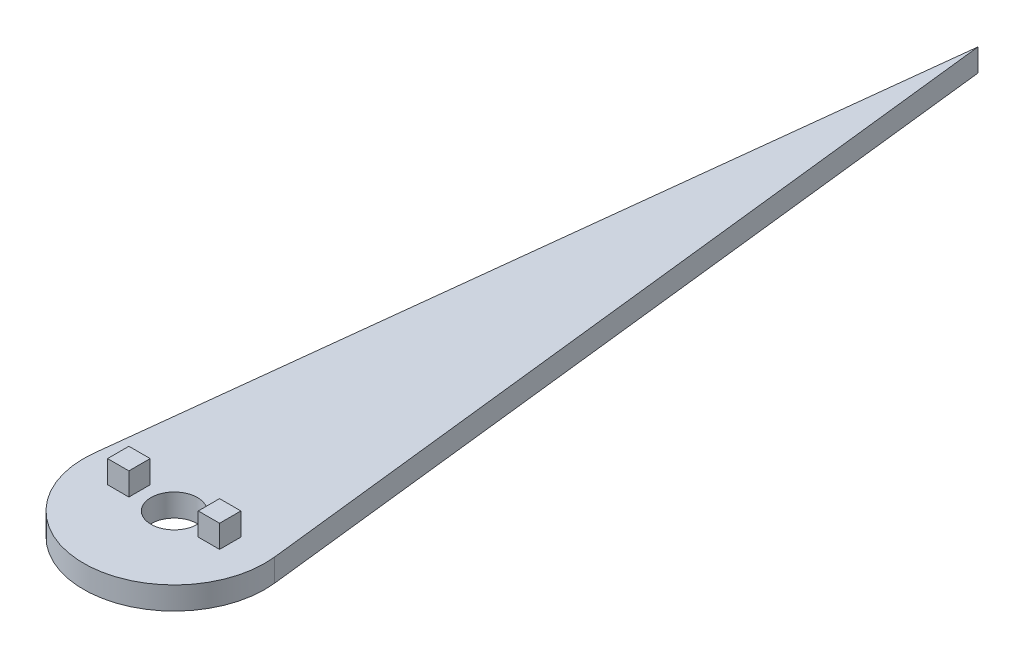
ISO-10303-21;
HEADER;
FILE_DESCRIPTION(('STEP AP214'),'2;1');
FILE_NAME('part.step','',(''),(''),'','','');
FILE_SCHEMA(('AUTOMOTIVE_DESIGN { 1 0 10303 214 1 1 1 1 }'));
ENDSEC;
DATA;
#1=APPLICATION_CONTEXT('core data for automotive mechanical design processes');
#2=APPLICATION_PROTOCOL_DEFINITION('international standard','automotive_design',2000,#1);
#3=PRODUCT_CONTEXT('',#1,'mechanical');
#4=PRODUCT('Part','Part','',(#3));
#5=PRODUCT_RELATED_PRODUCT_CATEGORY('part','',(#4));
#6=PRODUCT_DEFINITION_FORMATION('','',#4);
#7=PRODUCT_DEFINITION_CONTEXT('part definition',#1,'design');
#8=PRODUCT_DEFINITION('design','',#6,#7);
#9=PRODUCT_DEFINITION_SHAPE('','',#8);
#10=(LENGTH_UNIT() NAMED_UNIT(*) SI_UNIT(.MILLI.,.METRE.));
#11=(NAMED_UNIT(*) PLANE_ANGLE_UNIT() SI_UNIT($,.RADIAN.));
#12=(NAMED_UNIT(*) SI_UNIT($,.STERADIAN.) SOLID_ANGLE_UNIT());
#13=UNCERTAINTY_MEASURE_WITH_UNIT(LENGTH_MEASURE(1.E-05),#10,'distance_accuracy_value','');
#14=(GEOMETRIC_REPRESENTATION_CONTEXT(3) GLOBAL_UNCERTAINTY_ASSIGNED_CONTEXT((#13)) GLOBAL_UNIT_ASSIGNED_CONTEXT((#10,
#11,#12)) REPRESENTATION_CONTEXT('',''));
#15=CARTESIAN_POINT('',(0.,0.,0.));
#16=DIRECTION('',(0.,0.,1.));
#17=DIRECTION('',(1.,0.,0.));
#18=AXIS2_PLACEMENT_3D('',#15,#16,#17);
#19=CARTESIAN_POINT('',(0.,5.,0.));
#20=DIRECTION('',(0.,1.,0.));
#21=DIRECTION('',(0.,0.,1.));
#22=AXIS2_PLACEMENT_3D('',#19,#20,#21);
#23=PLANE('',#22);
#24=CARTESIAN_POINT('',(0.,5.,0.));
#25=DIRECTION('',(0.,1.,0.));
#26=DIRECTION('',(0.,0.,1.));
#27=AXIS2_PLACEMENT_3D('',#24,#25,#26);
#28=CIRCLE('',#27,20.);
#29=CARTESIAN_POINT('',(-19.8722843965965,5.,-2.2566153550812));
#30=VERTEX_POINT('',#29);
#31=CARTESIAN_POINT('',(19.8722843965965,5.,-2.25661535508119));
#32=VERTEX_POINT('',#31);
#33=EDGE_CURVE('E217',#30,#32,#28,.T.);
#34=ORIENTED_EDGE('',*,*,#33,.T.);
#35=DIRECTION('',(-0.11283076775406,0.,-0.993614219829824));
#36=VECTOR('',#35,1.);
#37=CARTESIAN_POINT('',(0.,5.,-177.256615355081));
#38=LINE('',#37,#36);
#39=CARTESIAN_POINT('',(0.,5.,-177.256615355081));
#40=VERTEX_POINT('',#39);
#41=EDGE_CURVE('E221',#32,#40,#38,.T.);
#42=ORIENTED_EDGE('',*,*,#41,.T.);
#43=DIRECTION('',(-0.112830767754061,0.,0.993614219829824));
#44=VECTOR('',#43,1.);
#45=CARTESIAN_POINT('',(-19.8722843965965,5.,-2.2566153550812));
#46=LINE('',#45,#44);
#47=EDGE_CURVE('E225',#40,#30,#46,.T.);
#48=ORIENTED_EDGE('',*,*,#47,.T.);
#49=EDGE_LOOP('',(#34,#42,#48));
#50=FACE_BOUND('',#49,.T.);
#51=CARTESIAN_POINT('',(0.,5.,0.));
#52=DIRECTION('',(0.,1.,0.));
#53=DIRECTION('',(0.,0.,1.));
#54=AXIS2_PLACEMENT_3D('',#51,#52,#53);
#55=CIRCLE('',#54,5.125);
#56=CARTESIAN_POINT('',(0.,5.,5.12500000000001));
#57=VERTEX_POINT('',#56);
#58=EDGE_CURVE('E209',#57,#57,#55,.T.);
#59=ORIENTED_EDGE('',*,*,#58,.F.);
#60=EDGE_LOOP('',(#59));
#61=FACE_BOUND('',#60,.T.);
#62=DIRECTION('',(-1.,0.,0.));
#63=VECTOR('',#62,1.);
#64=CARTESIAN_POINT('',(7.65,5.,-2.35));
#65=LINE('',#64,#63);
#66=CARTESIAN_POINT('',(12.35,5.,-2.35));
#67=VERTEX_POINT('',#66);
#68=CARTESIAN_POINT('',(7.65,5.,-2.35));
#69=VERTEX_POINT('',#68);
#70=EDGE_CURVE('E159',#67,#69,#65,.T.);
#71=ORIENTED_EDGE('',*,*,#70,.F.);
#72=DIRECTION('',(0.,0.,-1.));
#73=VECTOR('',#72,1.);
#74=CARTESIAN_POINT('',(12.35,5.,2.35));
#75=LINE('',#74,#73);
#76=CARTESIAN_POINT('',(12.35,5.,2.35));
#77=VERTEX_POINT('',#76);
#78=EDGE_CURVE('E154',#77,#67,#75,.T.);
#79=ORIENTED_EDGE('',*,*,#78,.F.);
#80=DIRECTION('',(1.,0.,0.));
#81=VECTOR('',#80,1.);
#82=CARTESIAN_POINT('',(7.65,5.,2.35));
#83=LINE('',#82,#81);
#84=CARTESIAN_POINT('',(7.65,5.,2.35));
#85=VERTEX_POINT('',#84);
#86=EDGE_CURVE('E179',#85,#77,#83,.T.);
#87=ORIENTED_EDGE('',*,*,#86,.F.);
#88=DIRECTION('',(0.,0.,1.));
#89=VECTOR('',#88,1.);
#90=CARTESIAN_POINT('',(7.65,5.,2.35));
#91=LINE('',#90,#89);
#92=EDGE_CURVE('E191',#69,#85,#91,.T.);
#93=ORIENTED_EDGE('',*,*,#92,.F.);
#94=EDGE_LOOP('',(#71,#79,#87,#93));
#95=FACE_BOUND('',#94,.T.);
#96=DIRECTION('',(-1.,0.,0.));
#97=VECTOR('',#96,1.);
#98=CARTESIAN_POINT('',(-12.35,5.,-2.35));
#99=LINE('',#98,#97);
#100=CARTESIAN_POINT('',(-7.65,5.,-2.35));
#101=VERTEX_POINT('',#100);
#102=CARTESIAN_POINT('',(-12.35,5.,-2.35));
#103=VERTEX_POINT('',#102);
#104=EDGE_CURVE('E152',#101,#103,#99,.T.);
#105=ORIENTED_EDGE('',*,*,#104,.F.);
#106=DIRECTION('',(0.,0.,-1.));
#107=VECTOR('',#106,1.);
#108=CARTESIAN_POINT('',(-7.65,5.,2.35));
#109=LINE('',#108,#107);
#110=CARTESIAN_POINT('',(-7.65,5.,2.35));
#111=VERTEX_POINT('',#110);
#112=EDGE_CURVE('E146',#111,#101,#109,.T.);
#113=ORIENTED_EDGE('',*,*,#112,.F.);
#114=DIRECTION('',(1.,0.,0.));
#115=VECTOR('',#114,1.);
#116=CARTESIAN_POINT('',(-12.35,5.,2.35));
#117=LINE('',#116,#115);
#118=CARTESIAN_POINT('',(-12.35,5.,2.35));
#119=VERTEX_POINT('',#118);
#120=EDGE_CURVE('E130',#119,#111,#117,.T.);
#121=ORIENTED_EDGE('',*,*,#120,.F.);
#122=DIRECTION('',(0.,0.,1.));
#123=VECTOR('',#122,1.);
#124=CARTESIAN_POINT('',(-12.35,5.,2.35));
#125=LINE('',#124,#123);
#126=EDGE_CURVE('E139',#103,#119,#125,.T.);
#127=ORIENTED_EDGE('',*,*,#126,.F.);
#128=EDGE_LOOP('',(#105,#113,#121,#127));
#129=FACE_BOUND('',#128,.T.);
#130=ADVANCED_FACE('F45',(#50,#61,#95,#129),#23,.T.);
#131=CARTESIAN_POINT('',(0.,0.,0.));
#132=DIRECTION('',(0.,1.,0.));
#133=DIRECTION('',(0.,0.,1.));
#134=AXIS2_PLACEMENT_3D('',#131,#132,#133);
#135=PLANE('',#134);
#136=CARTESIAN_POINT('',(0.,0.,0.));
#137=DIRECTION('',(0.,1.,0.));
#138=DIRECTION('',(0.,0.,1.));
#139=AXIS2_PLACEMENT_3D('',#136,#137,#138);
#140=CIRCLE('',#139,20.);
#141=CARTESIAN_POINT('',(-19.8722843965965,0.,-2.2566153550812));
#142=VERTEX_POINT('',#141);
#143=CARTESIAN_POINT('',(19.8722843965965,0.,-2.25661535508119));
#144=VERTEX_POINT('',#143);
#145=EDGE_CURVE('E213',#142,#144,#140,.T.);
#146=ORIENTED_EDGE('',*,*,#145,.F.);
#147=DIRECTION('',(-0.112830767754061,0.,0.993614219829824));
#148=VECTOR('',#147,1.);
#149=CARTESIAN_POINT('',(-19.8722843965965,0.,-2.2566153550812));
#150=LINE('',#149,#148);
#151=CARTESIAN_POINT('',(0.,0.,-177.256615355081));
#152=VERTEX_POINT('',#151);
#153=EDGE_CURVE('E222',#152,#142,#150,.T.);
#154=ORIENTED_EDGE('',*,*,#153,.F.);
#155=DIRECTION('',(-0.11283076775406,0.,-0.993614219829824));
#156=VECTOR('',#155,1.);
#157=CARTESIAN_POINT('',(0.,0.,-177.256615355081));
#158=LINE('',#157,#156);
#159=EDGE_CURVE('E232',#144,#152,#158,.T.);
#160=ORIENTED_EDGE('',*,*,#159,.F.);
#161=EDGE_LOOP('',(#146,#154,#160));
#162=FACE_BOUND('',#161,.T.);
#163=CARTESIAN_POINT('',(0.,0.,0.));
#164=DIRECTION('',(0.,1.,0.));
#165=DIRECTION('',(0.,0.,1.));
#166=AXIS2_PLACEMENT_3D('',#163,#164,#165);
#167=CIRCLE('',#166,5.125);
#168=CARTESIAN_POINT('',(0.,0.,5.12500000000001));
#169=VERTEX_POINT('',#168);
#170=EDGE_CURVE('E208',#169,#169,#167,.T.);
#171=ORIENTED_EDGE('',*,*,#170,.T.);
#172=EDGE_LOOP('',(#171));
#173=FACE_BOUND('',#172,.T.);
#174=ADVANCED_FACE('F250',(#162,#173),#135,.F.);
#175=CARTESIAN_POINT('',(0.,5.,0.));
#176=DIRECTION('',(0.,-1.,0.));
#177=DIRECTION('',(0.,0.,-1.));
#178=AXIS2_PLACEMENT_3D('',#175,#176,#177);
#179=CYLINDRICAL_SURFACE('',#178,20.);
#180=ORIENTED_EDGE('',*,*,#145,.T.);
#181=DIRECTION('',(0.,-1.,0.));
#182=VECTOR('',#181,1.);
#183=CARTESIAN_POINT('',(19.8722843965965,5.,-2.25661535508119));
#184=LINE('',#183,#182);
#185=EDGE_CURVE('E11',#32,#144,#184,.T.);
#186=ORIENTED_EDGE('',*,*,#185,.F.);
#187=ORIENTED_EDGE('',*,*,#33,.F.);
#188=DIRECTION('',(0.,-1.,0.));
#189=VECTOR('',#188,1.);
#190=CARTESIAN_POINT('',(-19.8722843965965,5.,-2.2566153550812));
#191=LINE('',#190,#189);
#192=EDGE_CURVE('E228',#30,#142,#191,.T.);
#193=ORIENTED_EDGE('',*,*,#192,.T.);
#194=EDGE_LOOP('',(#180,#186,#187,#193));
#195=FACE_BOUND('',#194,.T.);
#196=ADVANCED_FACE('F47',(#195),#179,.T.);
#197=CARTESIAN_POINT('',(0.,5.,-177.256615355081));
#198=DIRECTION('',(-0.993614219829824,0.,0.112830767754061));
#199=DIRECTION('',(0.112830767754061,0.,0.993614219829824));
#200=AXIS2_PLACEMENT_3D('',#197,#198,#199);
#201=PLANE('',#200);
#202=ORIENTED_EDGE('',*,*,#159,.T.);
#203=DIRECTION('',(0.,-1.,0.));
#204=VECTOR('',#203,1.);
#205=CARTESIAN_POINT('',(0.,5.,-177.256615355081));
#206=LINE('',#205,#204);
#207=EDGE_CURVE('E54',#40,#152,#206,.T.);
#208=ORIENTED_EDGE('',*,*,#207,.F.);
#209=ORIENTED_EDGE('',*,*,#41,.F.);
#210=ORIENTED_EDGE('',*,*,#185,.T.);
#211=EDGE_LOOP('',(#202,#208,#209,#210));
#212=FACE_BOUND('',#211,.T.);
#213=ADVANCED_FACE('F257',(#212),#201,.F.);
#214=CARTESIAN_POINT('',(-19.8722843965965,5.,-2.2566153550812));
#215=DIRECTION('',(0.993614219829824,0.,0.112830767754061));
#216=DIRECTION('',(0.112830767754061,0.,-0.993614219829824));
#217=AXIS2_PLACEMENT_3D('',#214,#215,#216);
#218=PLANE('',#217);
#219=ORIENTED_EDGE('',*,*,#153,.T.);
#220=ORIENTED_EDGE('',*,*,#192,.F.);
#221=ORIENTED_EDGE('',*,*,#47,.F.);
#222=ORIENTED_EDGE('',*,*,#207,.T.);
#223=EDGE_LOOP('',(#219,#220,#221,#222));
#224=FACE_BOUND('',#223,.T.);
#225=ADVANCED_FACE('F245',(#224),#218,.F.);
#226=CARTESIAN_POINT('',(0.,5.,0.));
#227=DIRECTION('',(0.,-1.,0.));
#228=DIRECTION('',(0.,0.,-1.));
#229=AXIS2_PLACEMENT_3D('',#226,#227,#228);
#230=CYLINDRICAL_SURFACE('',#229,5.125);
#231=ORIENTED_EDGE('',*,*,#58,.T.);
#232=EDGE_LOOP('',(#231));
#233=FACE_BOUND('',#232,.T.);
#234=ORIENTED_EDGE('',*,*,#170,.F.);
#235=EDGE_LOOP('',(#234));
#236=FACE_BOUND('',#235,.T.);
#237=ADVANCED_FACE('F263',(#233,#236),#230,.F.);
#238=CARTESIAN_POINT('',(12.35,10.,2.35));
#239=DIRECTION('',(-1.,0.,0.));
#240=DIRECTION('',(0.,0.,1.));
#241=AXIS2_PLACEMENT_3D('',#238,#239,#240);
#242=PLANE('',#241);
#243=ORIENTED_EDGE('',*,*,#78,.T.);
#244=DIRECTION('',(0.,-1.,0.));
#245=VECTOR('',#244,1.);
#246=CARTESIAN_POINT('',(12.35,10.,-2.35));
#247=LINE('',#246,#245);
#248=CARTESIAN_POINT('',(12.35,10.,-2.35));
#249=VERTEX_POINT('',#248);
#250=EDGE_CURVE('E205',#249,#67,#247,.T.);
#251=ORIENTED_EDGE('',*,*,#250,.F.);
#252=DIRECTION('',(0.,0.,-1.));
#253=VECTOR('',#252,1.);
#254=CARTESIAN_POINT('',(12.35,10.,2.35));
#255=LINE('',#254,#253);
#256=CARTESIAN_POINT('',(12.35,10.,2.35));
#257=VERTEX_POINT('',#256);
#258=EDGE_CURVE('E174',#257,#249,#255,.T.);
#259=ORIENTED_EDGE('',*,*,#258,.F.);
#260=DIRECTION('',(0.,-1.,0.));
#261=VECTOR('',#260,1.);
#262=CARTESIAN_POINT('',(12.35,10.,2.35));
#263=LINE('',#262,#261);
#264=EDGE_CURVE('E187',#257,#77,#263,.T.);
#265=ORIENTED_EDGE('',*,*,#264,.T.);
#266=EDGE_LOOP('',(#243,#251,#259,#265));
#267=FACE_BOUND('',#266,.T.);
#268=ADVANCED_FACE('F274',(#267),#242,.F.);
#269=CARTESIAN_POINT('',(7.65,10.,-2.35));
#270=DIRECTION('',(0.,0.,1.));
#271=DIRECTION('',(1.,0.,0.));
#272=AXIS2_PLACEMENT_3D('',#269,#270,#271);
#273=PLANE('',#272);
#274=ORIENTED_EDGE('',*,*,#70,.T.);
#275=DIRECTION('',(0.,-1.,0.));
#276=VECTOR('',#275,1.);
#277=CARTESIAN_POINT('',(7.65,10.,-2.35));
#278=LINE('',#277,#276);
#279=CARTESIAN_POINT('',(7.65,10.,-2.35));
#280=VERTEX_POINT('',#279);
#281=EDGE_CURVE('E201',#280,#69,#278,.T.);
#282=ORIENTED_EDGE('',*,*,#281,.F.);
#283=DIRECTION('',(-1.,0.,0.));
#284=VECTOR('',#283,1.);
#285=CARTESIAN_POINT('',(7.65,10.,-2.35));
#286=LINE('',#285,#284);
#287=EDGE_CURVE('E178',#249,#280,#286,.T.);
#288=ORIENTED_EDGE('',*,*,#287,.F.);
#289=ORIENTED_EDGE('',*,*,#250,.T.);
#290=EDGE_LOOP('',(#274,#282,#288,#289));
#291=FACE_BOUND('',#290,.T.);
#292=ADVANCED_FACE('F278',(#291),#273,.F.);
#293=CARTESIAN_POINT('',(7.65,10.,2.35));
#294=DIRECTION('',(1.,0.,0.));
#295=DIRECTION('',(0.,0.,-1.));
#296=AXIS2_PLACEMENT_3D('',#293,#294,#295);
#297=PLANE('',#296);
#298=ORIENTED_EDGE('',*,*,#92,.T.);
#299=DIRECTION('',(0.,-1.,0.));
#300=VECTOR('',#299,1.);
#301=CARTESIAN_POINT('',(7.65,10.,2.35));
#302=LINE('',#301,#300);
#303=CARTESIAN_POINT('',(7.65,10.,2.35));
#304=VERTEX_POINT('',#303);
#305=EDGE_CURVE('E69',#304,#85,#302,.T.);
#306=ORIENTED_EDGE('',*,*,#305,.F.);
#307=DIRECTION('',(0.,0.,1.));
#308=VECTOR('',#307,1.);
#309=CARTESIAN_POINT('',(7.65,10.,2.35));
#310=LINE('',#309,#308);
#311=EDGE_CURVE('E182',#280,#304,#310,.T.);
#312=ORIENTED_EDGE('',*,*,#311,.F.);
#313=ORIENTED_EDGE('',*,*,#281,.T.);
#314=EDGE_LOOP('',(#298,#306,#312,#313));
#315=FACE_BOUND('',#314,.T.);
#316=ADVANCED_FACE('F282',(#315),#297,.F.);
#317=CARTESIAN_POINT('',(7.65,10.,2.35));
#318=DIRECTION('',(0.,0.,-1.));
#319=DIRECTION('',(-1.,0.,0.));
#320=AXIS2_PLACEMENT_3D('',#317,#318,#319);
#321=PLANE('',#320);
#322=ORIENTED_EDGE('',*,*,#86,.T.);
#323=ORIENTED_EDGE('',*,*,#264,.F.);
#324=DIRECTION('',(1.,0.,0.));
#325=VECTOR('',#324,1.);
#326=CARTESIAN_POINT('',(7.65,10.,2.35));
#327=LINE('',#326,#325);
#328=EDGE_CURVE('E185',#304,#257,#327,.T.);
#329=ORIENTED_EDGE('',*,*,#328,.F.);
#330=ORIENTED_EDGE('',*,*,#305,.T.);
#331=EDGE_LOOP('',(#322,#323,#329,#330));
#332=FACE_BOUND('',#331,.T.);
#333=ADVANCED_FACE('F286',(#332),#321,.F.);
#334=CARTESIAN_POINT('',(0.,10.,0.));
#335=DIRECTION('',(0.,-1.,0.));
#336=DIRECTION('',(0.,0.,-1.));
#337=AXIS2_PLACEMENT_3D('',#334,#335,#336);
#338=PLANE('',#337);
#339=ORIENTED_EDGE('',*,*,#258,.T.);
#340=ORIENTED_EDGE('',*,*,#287,.T.);
#341=ORIENTED_EDGE('',*,*,#311,.T.);
#342=ORIENTED_EDGE('',*,*,#328,.T.);
#343=EDGE_LOOP('',(#339,#340,#341,#342));
#344=FACE_BOUND('',#343,.T.);
#345=ADVANCED_FACE('F290',(#344),#338,.F.);
#346=CARTESIAN_POINT('',(-7.65,10.,2.35));
#347=DIRECTION('',(-1.,0.,0.));
#348=DIRECTION('',(0.,0.,1.));
#349=AXIS2_PLACEMENT_3D('',#346,#347,#348);
#350=PLANE('',#349);
#351=ORIENTED_EDGE('',*,*,#112,.T.);
#352=DIRECTION('',(0.,-1.,0.));
#353=VECTOR('',#352,1.);
#354=CARTESIAN_POINT('',(-7.65,10.,-2.35));
#355=LINE('',#354,#353);
#356=CARTESIAN_POINT('',(-7.65,10.,-2.35));
#357=VERTEX_POINT('',#356);
#358=EDGE_CURVE('E469',#357,#101,#355,.T.);
#359=ORIENTED_EDGE('',*,*,#358,.F.);
#360=DIRECTION('',(0.,0.,-1.));
#361=VECTOR('',#360,1.);
#362=CARTESIAN_POINT('',(-7.65,10.,2.35));
#363=LINE('',#362,#361);
#364=CARTESIAN_POINT('',(-7.65,10.,2.35));
#365=VERTEX_POINT('',#364);
#366=EDGE_CURVE('E140',#365,#357,#363,.T.);
#367=ORIENTED_EDGE('',*,*,#366,.F.);
#368=DIRECTION('',(0.,-1.,0.));
#369=VECTOR('',#368,1.);
#370=CARTESIAN_POINT('',(-7.65,10.,2.35));
#371=LINE('',#370,#369);
#372=EDGE_CURVE('E133',#365,#111,#371,.T.);
#373=ORIENTED_EDGE('',*,*,#372,.T.);
#374=EDGE_LOOP('',(#351,#359,#367,#373));
#375=FACE_BOUND('',#374,.T.);
#376=ADVANCED_FACE('F144',(#375),#350,.F.);
#377=CARTESIAN_POINT('',(-12.35,10.,-2.35));
#378=DIRECTION('',(0.,0.,1.));
#379=DIRECTION('',(1.,0.,0.));
#380=AXIS2_PLACEMENT_3D('',#377,#378,#379);
#381=PLANE('',#380);
#382=ORIENTED_EDGE('',*,*,#104,.T.);
#383=DIRECTION('',(0.,-1.,0.));
#384=VECTOR('',#383,1.);
#385=CARTESIAN_POINT('',(-12.35,10.,-2.35));
#386=LINE('',#385,#384);
#387=CARTESIAN_POINT('',(-12.35,10.,-2.35));
#388=VERTEX_POINT('',#387);
#389=EDGE_CURVE('E467',#388,#103,#386,.T.);
#390=ORIENTED_EDGE('',*,*,#389,.F.);
#391=DIRECTION('',(-1.,0.,0.));
#392=VECTOR('',#391,1.);
#393=CARTESIAN_POINT('',(-12.35,10.,-2.35));
#394=LINE('',#393,#392);
#395=EDGE_CURVE('E169',#357,#388,#394,.T.);
#396=ORIENTED_EDGE('',*,*,#395,.F.);
#397=ORIENTED_EDGE('',*,*,#358,.T.);
#398=EDGE_LOOP('',(#382,#390,#396,#397));
#399=FACE_BOUND('',#398,.T.);
#400=ADVANCED_FACE('F303',(#399),#381,.F.);
#401=CARTESIAN_POINT('',(-12.35,10.,2.35));
#402=DIRECTION('',(1.,0.,0.));
#403=DIRECTION('',(0.,0.,-1.));
#404=AXIS2_PLACEMENT_3D('',#401,#402,#403);
#405=PLANE('',#404);
#406=ORIENTED_EDGE('',*,*,#126,.T.);
#407=DIRECTION('',(0.,-1.,0.));
#408=VECTOR('',#407,1.);
#409=CARTESIAN_POINT('',(-12.35,10.,2.35));
#410=LINE('',#409,#408);
#411=CARTESIAN_POINT('',(-12.35,10.,2.35));
#412=VERTEX_POINT('',#411);
#413=EDGE_CURVE('E61',#412,#119,#410,.T.);
#414=ORIENTED_EDGE('',*,*,#413,.F.);
#415=DIRECTION('',(0.,0.,1.));
#416=VECTOR('',#415,1.);
#417=CARTESIAN_POINT('',(-12.35,10.,2.35));
#418=LINE('',#417,#416);
#419=EDGE_CURVE('E166',#388,#412,#418,.T.);
#420=ORIENTED_EDGE('',*,*,#419,.F.);
#421=ORIENTED_EDGE('',*,*,#389,.T.);
#422=EDGE_LOOP('',(#406,#414,#420,#421));
#423=FACE_BOUND('',#422,.T.);
#424=ADVANCED_FACE('F300',(#423),#405,.F.);
#425=CARTESIAN_POINT('',(-12.35,10.,2.35));
#426=DIRECTION('',(0.,0.,-1.));
#427=DIRECTION('',(-1.,0.,0.));
#428=AXIS2_PLACEMENT_3D('',#425,#426,#427);
#429=PLANE('',#428);
#430=ORIENTED_EDGE('',*,*,#120,.T.);
#431=ORIENTED_EDGE('',*,*,#372,.F.);
#432=DIRECTION('',(1.,0.,0.));
#433=VECTOR('',#432,1.);
#434=CARTESIAN_POINT('',(-12.35,10.,2.35));
#435=LINE('',#434,#433);
#436=EDGE_CURVE('E150',#412,#365,#435,.T.);
#437=ORIENTED_EDGE('',*,*,#436,.F.);
#438=ORIENTED_EDGE('',*,*,#413,.T.);
#439=EDGE_LOOP('',(#430,#431,#437,#438));
#440=FACE_BOUND('',#439,.T.);
#441=ADVANCED_FACE('F132',(#440),#429,.F.);
#442=CARTESIAN_POINT('',(0.,10.,0.));
#443=DIRECTION('',(0.,-1.,0.));
#444=DIRECTION('',(0.,0.,-1.));
#445=AXIS2_PLACEMENT_3D('',#442,#443,#444);
#446=PLANE('',#445);
#447=ORIENTED_EDGE('',*,*,#366,.T.);
#448=ORIENTED_EDGE('',*,*,#395,.T.);
#449=ORIENTED_EDGE('',*,*,#419,.T.);
#450=ORIENTED_EDGE('',*,*,#436,.T.);
#451=EDGE_LOOP('',(#447,#448,#449,#450));
#452=FACE_BOUND('',#451,.T.);
#453=ADVANCED_FACE('F294',(#452),#446,.F.);
#454=CLOSED_SHELL('',(#130,#174,#196,#213,#225,#237,#268,#292,#316,#333,#345,#376,#400,#424,
#441,#453));
#455=MANIFOLD_SOLID_BREP('B2',#454);
#456=ADVANCED_BREP_SHAPE_REPRESENTATION('',(#18,#455),#14);
#457=SHAPE_DEFINITION_REPRESENTATION(#9,#456);
ENDSEC;
END-ISO-10303-21;
